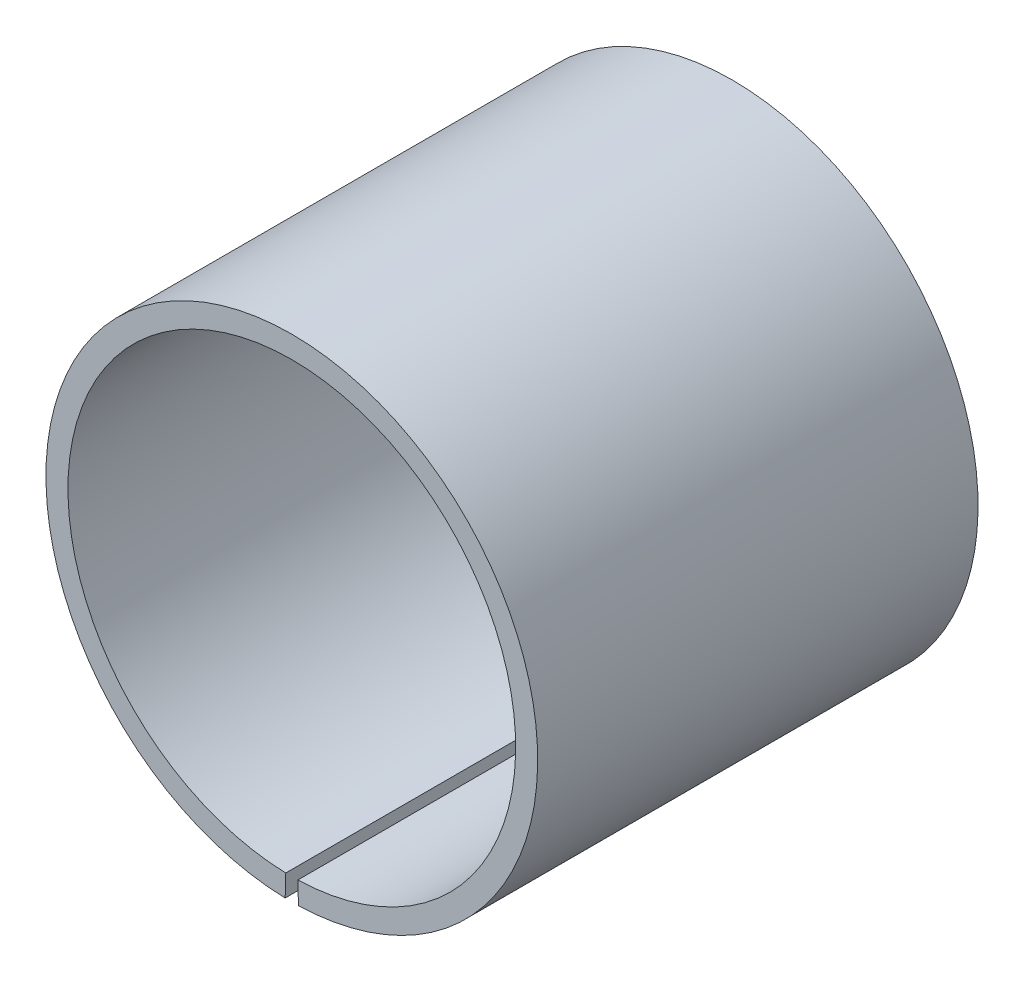
ISO-10303-21;
HEADER;
FILE_DESCRIPTION(('STEP AP214'),'2;1');
FILE_NAME('part.step','',(''),(''),'','','');
FILE_SCHEMA(('AUTOMOTIVE_DESIGN { 1 0 10303 214 1 1 1 1 }'));
ENDSEC;
DATA;
#1=APPLICATION_CONTEXT('core data for automotive mechanical design processes');
#2=APPLICATION_PROTOCOL_DEFINITION('international standard','automotive_design',2000,#1);
#3=PRODUCT_CONTEXT('',#1,'mechanical');
#4=PRODUCT('Part','Part','',(#3));
#5=PRODUCT_RELATED_PRODUCT_CATEGORY('part','',(#4));
#6=PRODUCT_DEFINITION_FORMATION('','',#4);
#7=PRODUCT_DEFINITION_CONTEXT('part definition',#1,'design');
#8=PRODUCT_DEFINITION('design','',#6,#7);
#9=PRODUCT_DEFINITION_SHAPE('','',#8);
#10=(LENGTH_UNIT() NAMED_UNIT(*) SI_UNIT(.MILLI.,.METRE.));
#11=(NAMED_UNIT(*) PLANE_ANGLE_UNIT() SI_UNIT($,.RADIAN.));
#12=(NAMED_UNIT(*) SI_UNIT($,.STERADIAN.) SOLID_ANGLE_UNIT());
#13=UNCERTAINTY_MEASURE_WITH_UNIT(LENGTH_MEASURE(1.E-05),#10,'distance_accuracy_value','');
#14=(GEOMETRIC_REPRESENTATION_CONTEXT(3) GLOBAL_UNCERTAINTY_ASSIGNED_CONTEXT((#13)) GLOBAL_UNIT_ASSIGNED_CONTEXT((#10,
#11,#12)) REPRESENTATION_CONTEXT('',''));
#15=CARTESIAN_POINT('',(0.,0.,0.));
#16=DIRECTION('',(0.,0.,1.));
#17=DIRECTION('',(1.,0.,0.));
#18=AXIS2_PLACEMENT_3D('',#15,#16,#17);
#19=CARTESIAN_POINT('',(0.,0.,15.));
#20=DIRECTION('',(0.,0.,-1.));
#21=DIRECTION('',(-1.,0.,0.));
#22=AXIS2_PLACEMENT_3D('',#19,#20,#21);
#23=CYLINDRICAL_SURFACE('',#22,16.75);
#24=CARTESIAN_POINT('',(0.,0.,-15.));
#25=DIRECTION('',(0.,0.,1.));
#26=DIRECTION('',(1.,0.,0.));
#27=AXIS2_PLACEMENT_3D('',#24,#25,#26);
#28=CIRCLE('',#27,16.75);
#29=CARTESIAN_POINT('',(0.452339325828944,-16.7438910989742,-15.));
#30=VERTEX_POINT('',#29);
#31=CARTESIAN_POINT('',(-0.452339325828939,-16.7438910989742,-15.));
#32=VERTEX_POINT('',#31);
#33=EDGE_CURVE('E102',#30,#32,#28,.T.);
#34=ORIENTED_EDGE('',*,*,#33,.T.);
#35=DIRECTION('',(0.,0.,-1.));
#36=VECTOR('',#35,1.);
#37=CARTESIAN_POINT('',(-0.452339325828939,-16.7438910989742,15.));
#38=LINE('',#37,#36);
#39=CARTESIAN_POINT('',(-0.452339325828939,-16.7438910989742,15.));
#40=VERTEX_POINT('',#39);
#41=EDGE_CURVE('E11',#40,#32,#38,.T.);
#42=ORIENTED_EDGE('',*,*,#41,.F.);
#43=CARTESIAN_POINT('',(0.,0.,15.));
#44=DIRECTION('',(0.,0.,1.));
#45=DIRECTION('',(1.,0.,0.));
#46=AXIS2_PLACEMENT_3D('',#43,#44,#45);
#47=CIRCLE('',#46,16.75);
#48=CARTESIAN_POINT('',(0.452339325828944,-16.7438910989742,15.));
#49=VERTEX_POINT('',#48);
#50=EDGE_CURVE('E90',#49,#40,#47,.T.);
#51=ORIENTED_EDGE('',*,*,#50,.F.);
#52=DIRECTION('',(0.,0.,-1.));
#53=VECTOR('',#52,1.);
#54=CARTESIAN_POINT('',(0.452339325828944,-16.7438910989742,15.));
#55=LINE('',#54,#53);
#56=EDGE_CURVE('E98',#49,#30,#55,.T.);
#57=ORIENTED_EDGE('',*,*,#56,.T.);
#58=EDGE_LOOP('',(#34,#42,#51,#57));
#59=FACE_BOUND('',#58,.T.);
#60=ADVANCED_FACE('F39',(#59),#23,.T.);
#61=CARTESIAN_POINT('',(-0.411831326500975,-15.2444381647377,15.));
#62=DIRECTION('',(-0.999635289490999,0.0270053328853098,0.));
#63=DIRECTION('',(-0.0270053328853098,-0.999635289490999,0.));
#64=AXIS2_PLACEMENT_3D('',#61,#62,#63);
#65=PLANE('',#64);
#66=DIRECTION('',(0.0270053328853098,0.999635289490999,0.));
#67=VECTOR('',#66,1.);
#68=CARTESIAN_POINT('',(-0.411831326500975,-15.2444381647377,-15.));
#69=LINE('',#68,#67);
#70=CARTESIAN_POINT('',(-0.411831326500975,-15.2444381647377,-15.));
#71=VERTEX_POINT('',#70);
#72=EDGE_CURVE('E94',#32,#71,#69,.T.);
#73=ORIENTED_EDGE('',*,*,#72,.T.);
#74=DIRECTION('',(0.,0.,-1.));
#75=VECTOR('',#74,1.);
#76=CARTESIAN_POINT('',(-0.411831326500975,-15.2444381647377,15.));
#77=LINE('',#76,#75);
#78=CARTESIAN_POINT('',(-0.411831326500975,-15.2444381647377,15.));
#79=VERTEX_POINT('',#78);
#80=EDGE_CURVE('E47',#79,#71,#77,.T.);
#81=ORIENTED_EDGE('',*,*,#80,.F.);
#82=DIRECTION('',(0.0270053328853098,0.999635289490999,0.));
#83=VECTOR('',#82,1.);
#84=CARTESIAN_POINT('',(-0.411831326500975,-15.2444381647377,15.));
#85=LINE('',#84,#83);
#86=EDGE_CURVE('E85',#40,#79,#85,.T.);
#87=ORIENTED_EDGE('',*,*,#86,.F.);
#88=ORIENTED_EDGE('',*,*,#41,.T.);
#89=EDGE_LOOP('',(#73,#81,#87,#88));
#90=FACE_BOUND('',#89,.T.);
#91=ADVANCED_FACE('F93',(#90),#65,.F.);
#92=CARTESIAN_POINT('',(0.,0.,15.));
#93=DIRECTION('',(0.,0.,-1.));
#94=DIRECTION('',(-1.,0.,0.));
#95=AXIS2_PLACEMENT_3D('',#92,#93,#94);
#96=CYLINDRICAL_SURFACE('',#95,15.25);
#97=CARTESIAN_POINT('',(0.,0.,-15.));
#98=DIRECTION('',(0.,0.,-1.));
#99=DIRECTION('',(1.,0.,0.));
#100=AXIS2_PLACEMENT_3D('',#97,#98,#99);
#101=CIRCLE('',#100,15.25);
#102=CARTESIAN_POINT('',(0.411831326500973,-15.2444381647377,-15.));
#103=VERTEX_POINT('',#102);
#104=EDGE_CURVE('E72',#71,#103,#101,.T.);
#105=ORIENTED_EDGE('',*,*,#104,.T.);
#106=DIRECTION('',(0.,0.,-1.));
#107=VECTOR('',#106,1.);
#108=CARTESIAN_POINT('',(0.411831326500973,-15.2444381647377,15.));
#109=LINE('',#108,#107);
#110=CARTESIAN_POINT('',(0.411831326500973,-15.2444381647377,15.));
#111=VERTEX_POINT('',#110);
#112=EDGE_CURVE('E95',#111,#103,#109,.T.);
#113=ORIENTED_EDGE('',*,*,#112,.F.);
#114=CARTESIAN_POINT('',(0.,0.,15.));
#115=DIRECTION('',(0.,0.,-1.));
#116=DIRECTION('',(1.,0.,0.));
#117=AXIS2_PLACEMENT_3D('',#114,#115,#116);
#118=CIRCLE('',#117,15.25);
#119=EDGE_CURVE('E88',#79,#111,#118,.T.);
#120=ORIENTED_EDGE('',*,*,#119,.F.);
#121=ORIENTED_EDGE('',*,*,#80,.T.);
#122=EDGE_LOOP('',(#105,#113,#120,#121));
#123=FACE_BOUND('',#122,.T.);
#124=ADVANCED_FACE('F96',(#123),#96,.F.);
#125=CARTESIAN_POINT('',(0.452339325828944,-16.7438910989742,15.));
#126=DIRECTION('',(0.999635289490999,0.0270053328853101,0.));
#127=DIRECTION('',(-0.0270053328853101,0.999635289490999,0.));
#128=AXIS2_PLACEMENT_3D('',#125,#126,#127);
#129=PLANE('',#128);
#130=DIRECTION('',(0.0270053328853101,-0.999635289490999,0.));
#131=VECTOR('',#130,1.);
#132=CARTESIAN_POINT('',(0.452339325828944,-16.7438910989742,-15.));
#133=LINE('',#132,#131);
#134=EDGE_CURVE('E78',#103,#30,#133,.T.);
#135=ORIENTED_EDGE('',*,*,#134,.T.);
#136=ORIENTED_EDGE('',*,*,#56,.F.);
#137=DIRECTION('',(0.0270053328853101,-0.999635289490999,0.));
#138=VECTOR('',#137,1.);
#139=CARTESIAN_POINT('',(0.452339325828944,-16.7438910989742,15.));
#140=LINE('',#139,#138);
#141=EDGE_CURVE('E55',#111,#49,#140,.T.);
#142=ORIENTED_EDGE('',*,*,#141,.F.);
#143=ORIENTED_EDGE('',*,*,#112,.T.);
#144=EDGE_LOOP('',(#135,#136,#142,#143));
#145=FACE_BOUND('',#144,.T.);
#146=ADVANCED_FACE('F109',(#145),#129,.F.);
#147=CARTESIAN_POINT('',(0.,0.,15.));
#148=DIRECTION('',(0.,0.,1.));
#149=DIRECTION('',(1.,0.,0.));
#150=AXIS2_PLACEMENT_3D('',#147,#148,#149);
#151=PLANE('',#150);
#152=ORIENTED_EDGE('',*,*,#50,.T.);
#153=ORIENTED_EDGE('',*,*,#86,.T.);
#154=ORIENTED_EDGE('',*,*,#119,.T.);
#155=ORIENTED_EDGE('',*,*,#141,.T.);
#156=EDGE_LOOP('',(#152,#153,#154,#155));
#157=FACE_BOUND('',#156,.T.);
#158=ADVANCED_FACE('F86',(#157),#151,.T.);
#159=CARTESIAN_POINT('',(0.,0.,-15.));
#160=DIRECTION('',(0.,0.,1.));
#161=DIRECTION('',(1.,0.,0.));
#162=AXIS2_PLACEMENT_3D('',#159,#160,#161);
#163=PLANE('',#162);
#164=ORIENTED_EDGE('',*,*,#33,.F.);
#165=ORIENTED_EDGE('',*,*,#134,.F.);
#166=ORIENTED_EDGE('',*,*,#104,.F.);
#167=ORIENTED_EDGE('',*,*,#72,.F.);
#168=EDGE_LOOP('',(#164,#165,#166,#167));
#169=FACE_BOUND('',#168,.T.);
#170=ADVANCED_FACE('F112',(#169),#163,.F.);
#171=CLOSED_SHELL('',(#60,#91,#124,#146,#158,#170));
#172=MANIFOLD_SOLID_BREP('B2',#171);
#173=ADVANCED_BREP_SHAPE_REPRESENTATION('',(#18,#172),#14);
#174=SHAPE_DEFINITION_REPRESENTATION(#9,#173);
ENDSEC;
END-ISO-10303-21;
